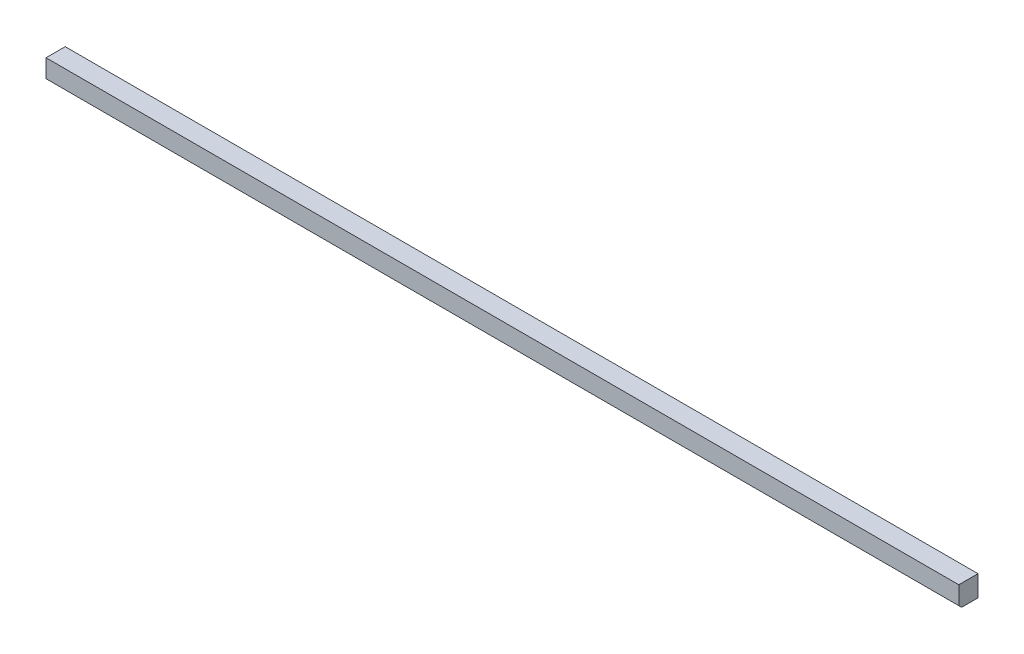
ISO-10303-21;
HEADER;
FILE_DESCRIPTION(('STEP AP214'),'2;1');
FILE_NAME('part.step','',(''),(''),'','','');
FILE_SCHEMA(('AUTOMOTIVE_DESIGN { 1 0 10303 214 1 1 1 1 }'));
ENDSEC;
DATA;
#1=APPLICATION_CONTEXT('core data for automotive mechanical design processes');
#2=APPLICATION_PROTOCOL_DEFINITION('international standard','automotive_design',2000,#1);
#3=PRODUCT_CONTEXT('',#1,'mechanical');
#4=PRODUCT('Part','Part','',(#3));
#5=PRODUCT_RELATED_PRODUCT_CATEGORY('part','',(#4));
#6=PRODUCT_DEFINITION_FORMATION('','',#4);
#7=PRODUCT_DEFINITION_CONTEXT('part definition',#1,'design');
#8=PRODUCT_DEFINITION('design','',#6,#7);
#9=PRODUCT_DEFINITION_SHAPE('','',#8);
#10=(LENGTH_UNIT() NAMED_UNIT(*) SI_UNIT(.MILLI.,.METRE.));
#11=(NAMED_UNIT(*) PLANE_ANGLE_UNIT() SI_UNIT($,.RADIAN.));
#12=(NAMED_UNIT(*) SI_UNIT($,.STERADIAN.) SOLID_ANGLE_UNIT());
#13=UNCERTAINTY_MEASURE_WITH_UNIT(LENGTH_MEASURE(1.E-05),#10,'distance_accuracy_value','');
#14=(GEOMETRIC_REPRESENTATION_CONTEXT(3) GLOBAL_UNCERTAINTY_ASSIGNED_CONTEXT((#13)) GLOBAL_UNIT_ASSIGNED_CONTEXT((#10,
#11,#12)) REPRESENTATION_CONTEXT('',''));
#15=CARTESIAN_POINT('',(0.,0.,0.));
#16=DIRECTION('',(0.,0.,1.));
#17=DIRECTION('',(1.,0.,0.));
#18=AXIS2_PLACEMENT_3D('',#15,#16,#17);
#19=CARTESIAN_POINT('',(0.,19.05,0.));
#20=DIRECTION('',(1.,0.,0.));
#21=DIRECTION('',(0.,0.,-1.));
#22=AXIS2_PLACEMENT_3D('',#19,#20,#21);
#23=PLANE('',#22);
#24=DIRECTION('',(0.,0.,1.));
#25=VECTOR('',#24,1.);
#26=CARTESIAN_POINT('',(0.,0.,0.));
#27=LINE('',#26,#25);
#28=CARTESIAN_POINT('',(0.,0.,-17.4625));
#29=VERTEX_POINT('',#28);
#30=CARTESIAN_POINT('',(0.,0.,-2.53999999999999));
#31=VERTEX_POINT('',#30);
#32=EDGE_CURVE('E125',#29,#31,#27,.T.);
#33=ORIENTED_EDGE('',*,*,#32,.T.);
#34=DIRECTION('',(0.,0.707106781186548,0.707106781186547));
#35=VECTOR('',#34,1.);
#36=CARTESIAN_POINT('',(0.,2.53999999999999,0.));
#37=LINE('',#36,#35);
#38=CARTESIAN_POINT('',(0.,2.53999999999999,0.));
#39=VERTEX_POINT('',#38);
#40=EDGE_CURVE('E11',#31,#39,#37,.T.);
#41=ORIENTED_EDGE('',*,*,#40,.T.);
#42=DIRECTION('',(0.,-1.,0.));
#43=VECTOR('',#42,1.);
#44=CARTESIAN_POINT('',(0.,19.05,0.));
#45=LINE('',#44,#43);
#46=CARTESIAN_POINT('',(0.,19.05,0.));
#47=VERTEX_POINT('',#46);
#48=EDGE_CURVE('E93',#47,#39,#45,.T.);
#49=ORIENTED_EDGE('',*,*,#48,.F.);
#50=DIRECTION('',(0.,0.,1.));
#51=VECTOR('',#50,1.);
#52=CARTESIAN_POINT('',(0.,19.05,0.));
#53=LINE('',#52,#51);
#54=CARTESIAN_POINT('',(0.,19.05,-17.4625));
#55=VERTEX_POINT('',#54);
#56=EDGE_CURVE('E99',#55,#47,#53,.T.);
#57=ORIENTED_EDGE('',*,*,#56,.F.);
#58=DIRECTION('',(0.,-1.,0.));
#59=VECTOR('',#58,1.);
#60=CARTESIAN_POINT('',(0.,19.05,-17.4625));
#61=LINE('',#60,#59);
#62=EDGE_CURVE('E120',#55,#29,#61,.T.);
#63=ORIENTED_EDGE('',*,*,#62,.T.);
#64=EDGE_LOOP('',(#33,#41,#49,#57,#63));
#65=FACE_BOUND('',#64,.T.);
#66=ADVANCED_FACE('F41',(#65),#23,.F.);
#67=CARTESIAN_POINT('',(0.,19.05,0.));
#68=DIRECTION('',(0.,0.,-1.));
#69=DIRECTION('',(-1.,0.,0.));
#70=AXIS2_PLACEMENT_3D('',#67,#68,#69);
#71=PLANE('',#70);
#72=ORIENTED_EDGE('',*,*,#48,.T.);
#73=DIRECTION('',(1.,0.,0.));
#74=VECTOR('',#73,1.);
#75=CARTESIAN_POINT('',(830.2625,2.53999999999999,0.));
#76=LINE('',#75,#74);
#77=CARTESIAN_POINT('',(830.2625,2.53999999999999,0.));
#78=VERTEX_POINT('',#77);
#79=EDGE_CURVE('E111',#39,#78,#76,.T.);
#80=ORIENTED_EDGE('',*,*,#79,.T.);
#81=DIRECTION('',(0.,-1.,0.));
#82=VECTOR('',#81,1.);
#83=CARTESIAN_POINT('',(830.2625,19.05,0.));
#84=LINE('',#83,#82);
#85=CARTESIAN_POINT('',(830.2625,19.05,0.));
#86=VERTEX_POINT('',#85);
#87=EDGE_CURVE('E95',#86,#78,#84,.T.);
#88=ORIENTED_EDGE('',*,*,#87,.F.);
#89=DIRECTION('',(1.,0.,0.));
#90=VECTOR('',#89,1.);
#91=CARTESIAN_POINT('',(0.,19.05,0.));
#92=LINE('',#91,#90);
#93=EDGE_CURVE('E88',#47,#86,#92,.T.);
#94=ORIENTED_EDGE('',*,*,#93,.F.);
#95=EDGE_LOOP('',(#72,#80,#88,#94));
#96=FACE_BOUND('',#95,.T.);
#97=ADVANCED_FACE('F90',(#96),#71,.F.);
#98=CARTESIAN_POINT('',(830.2625,19.05,0.));
#99=DIRECTION('',(-1.,0.,0.));
#100=DIRECTION('',(0.,0.,1.));
#101=AXIS2_PLACEMENT_3D('',#98,#99,#100);
#102=PLANE('',#101);
#103=ORIENTED_EDGE('',*,*,#87,.T.);
#104=DIRECTION('',(0.,-0.707106781186548,-0.707106781186547));
#105=VECTOR('',#104,1.);
#106=CARTESIAN_POINT('',(830.2625,2.53999999999999,0.));
#107=LINE('',#106,#105);
#108=CARTESIAN_POINT('',(830.2625,0.,-2.53999999999999));
#109=VERTEX_POINT('',#108);
#110=EDGE_CURVE('E64',#78,#109,#107,.T.);
#111=ORIENTED_EDGE('',*,*,#110,.T.);
#112=DIRECTION('',(0.,0.,-1.));
#113=VECTOR('',#112,1.);
#114=CARTESIAN_POINT('',(830.2625,0.,0.));
#115=LINE('',#114,#113);
#116=CARTESIAN_POINT('',(830.2625,0.,-17.4625));
#117=VERTEX_POINT('',#116);
#118=EDGE_CURVE('E123',#109,#117,#115,.T.);
#119=ORIENTED_EDGE('',*,*,#118,.T.);
#120=DIRECTION('',(0.,-1.,0.));
#121=VECTOR('',#120,1.);
#122=CARTESIAN_POINT('',(830.2625,19.05,-17.4625));
#123=LINE('',#122,#121);
#124=CARTESIAN_POINT('',(830.2625,19.05,-17.4625));
#125=VERTEX_POINT('',#124);
#126=EDGE_CURVE('E114',#125,#117,#123,.T.);
#127=ORIENTED_EDGE('',*,*,#126,.F.);
#128=DIRECTION('',(0.,0.,-1.));
#129=VECTOR('',#128,1.);
#130=CARTESIAN_POINT('',(830.2625,19.05,0.));
#131=LINE('',#130,#129);
#132=EDGE_CURVE('E98',#86,#125,#131,.T.);
#133=ORIENTED_EDGE('',*,*,#132,.F.);
#134=EDGE_LOOP('',(#103,#111,#119,#127,#133));
#135=FACE_BOUND('',#134,.T.);
#136=ADVANCED_FACE('F129',(#135),#102,.F.);
#137=CARTESIAN_POINT('',(0.,19.05,-17.4625));
#138=DIRECTION('',(0.,0.,1.));
#139=DIRECTION('',(1.,0.,0.));
#140=AXIS2_PLACEMENT_3D('',#137,#138,#139);
#141=PLANE('',#140);
#142=DIRECTION('',(-1.,0.,0.));
#143=VECTOR('',#142,1.);
#144=CARTESIAN_POINT('',(0.,0.,-17.4625));
#145=LINE('',#144,#143);
#146=EDGE_CURVE('E108',#117,#29,#145,.T.);
#147=ORIENTED_EDGE('',*,*,#146,.T.);
#148=ORIENTED_EDGE('',*,*,#62,.F.);
#149=DIRECTION('',(-1.,0.,0.));
#150=VECTOR('',#149,1.);
#151=CARTESIAN_POINT('',(0.,19.05,-17.4625));
#152=LINE('',#151,#150);
#153=EDGE_CURVE('E104',#125,#55,#152,.T.);
#154=ORIENTED_EDGE('',*,*,#153,.F.);
#155=ORIENTED_EDGE('',*,*,#126,.T.);
#156=EDGE_LOOP('',(#147,#148,#154,#155));
#157=FACE_BOUND('',#156,.T.);
#158=ADVANCED_FACE('F132',(#157),#141,.F.);
#159=CARTESIAN_POINT('',(0.,19.05,0.));
#160=DIRECTION('',(0.,-1.,0.));
#161=DIRECTION('',(0.,0.,-1.));
#162=AXIS2_PLACEMENT_3D('',#159,#160,#161);
#163=PLANE('',#162);
#164=ORIENTED_EDGE('',*,*,#56,.T.);
#165=ORIENTED_EDGE('',*,*,#93,.T.);
#166=ORIENTED_EDGE('',*,*,#132,.T.);
#167=ORIENTED_EDGE('',*,*,#153,.T.);
#168=EDGE_LOOP('',(#164,#165,#166,#167));
#169=FACE_BOUND('',#168,.T.);
#170=ADVANCED_FACE('F102',(#169),#163,.F.);
#171=CARTESIAN_POINT('',(0.,0.,0.));
#172=DIRECTION('',(0.,-1.,0.));
#173=DIRECTION('',(0.,0.,-1.));
#174=AXIS2_PLACEMENT_3D('',#171,#172,#173);
#175=PLANE('',#174);
#176=ORIENTED_EDGE('',*,*,#118,.F.);
#177=DIRECTION('',(-1.,0.,0.));
#178=VECTOR('',#177,1.);
#179=CARTESIAN_POINT('',(0.,0.,-2.53999999999999));
#180=LINE('',#179,#178);
#181=EDGE_CURVE('E50',#109,#31,#180,.T.);
#182=ORIENTED_EDGE('',*,*,#181,.T.);
#183=ORIENTED_EDGE('',*,*,#32,.F.);
#184=ORIENTED_EDGE('',*,*,#146,.F.);
#185=EDGE_LOOP('',(#176,#182,#183,#184));
#186=FACE_BOUND('',#185,.T.);
#187=ADVANCED_FACE('F133',(#186),#175,.T.);
#188=CARTESIAN_POINT('',(0.,2.53999999999999,0.));
#189=DIRECTION('',(0.,-0.707106781186547,0.707106781186548));
#190=DIRECTION('',(-1.,0.,0.));
#191=AXIS2_PLACEMENT_3D('',#188,#189,#190);
#192=PLANE('',#191);
#193=ORIENTED_EDGE('',*,*,#40,.F.);
#194=ORIENTED_EDGE('',*,*,#181,.F.);
#195=ORIENTED_EDGE('',*,*,#110,.F.);
#196=ORIENTED_EDGE('',*,*,#79,.F.);
#197=EDGE_LOOP('',(#193,#194,#195,#196));
#198=FACE_BOUND('',#197,.T.);
#199=ADVANCED_FACE('F44',(#198),#192,.T.);
#200=CLOSED_SHELL('',(#66,#97,#136,#158,#170,#187,#199));
#201=MANIFOLD_SOLID_BREP('B2',#200);
#202=ADVANCED_BREP_SHAPE_REPRESENTATION('',(#18,#201),#14);
#203=SHAPE_DEFINITION_REPRESENTATION(#9,#202);
ENDSEC;
END-ISO-10303-21;
